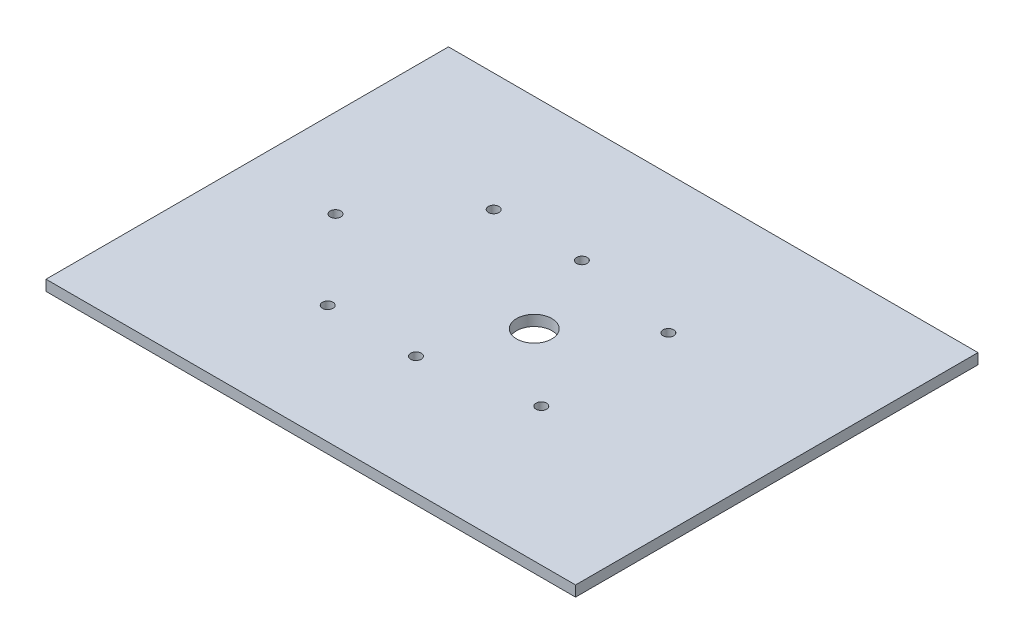
ISO-10303-21;
HEADER;
FILE_DESCRIPTION(('STEP AP214'),'2;1');
FILE_NAME('part.step','',(''),(''),'','','');
FILE_SCHEMA(('AUTOMOTIVE_DESIGN { 1 0 10303 214 1 1 1 1 }'));
ENDSEC;
DATA;
#1=APPLICATION_CONTEXT('core data for automotive mechanical design processes');
#2=APPLICATION_PROTOCOL_DEFINITION('international standard','automotive_design',2000,#1);
#3=PRODUCT_CONTEXT('',#1,'mechanical');
#4=PRODUCT('Part','Part','',(#3));
#5=PRODUCT_RELATED_PRODUCT_CATEGORY('part','',(#4));
#6=PRODUCT_DEFINITION_FORMATION('','',#4);
#7=PRODUCT_DEFINITION_CONTEXT('part definition',#1,'design');
#8=PRODUCT_DEFINITION('design','',#6,#7);
#9=PRODUCT_DEFINITION_SHAPE('','',#8);
#10=(LENGTH_UNIT() NAMED_UNIT(*) SI_UNIT(.MILLI.,.METRE.));
#11=(NAMED_UNIT(*) PLANE_ANGLE_UNIT() SI_UNIT($,.RADIAN.));
#12=(NAMED_UNIT(*) SI_UNIT($,.STERADIAN.) SOLID_ANGLE_UNIT());
#13=UNCERTAINTY_MEASURE_WITH_UNIT(LENGTH_MEASURE(1.E-05),#10,'distance_accuracy_value','');
#14=(GEOMETRIC_REPRESENTATION_CONTEXT(3) GLOBAL_UNCERTAINTY_ASSIGNED_CONTEXT((#13)) GLOBAL_UNIT_ASSIGNED_CONTEXT((#10,
#11,#12)) REPRESENTATION_CONTEXT('',''));
#15=CARTESIAN_POINT('',(0.,0.,0.));
#16=DIRECTION('',(0.,0.,1.));
#17=DIRECTION('',(1.,0.,0.));
#18=AXIS2_PLACEMENT_3D('',#15,#16,#17);
#19=CARTESIAN_POINT('',(0.,3.,114.));
#20=DIRECTION('',(1.,0.,0.));
#21=DIRECTION('',(0.,0.,-1.));
#22=AXIS2_PLACEMENT_3D('',#19,#20,#21);
#23=PLANE('',#22);
#24=DIRECTION('',(0.,0.,1.));
#25=VECTOR('',#24,1.);
#26=CARTESIAN_POINT('',(0.,0.,114.));
#27=LINE('',#26,#25);
#28=CARTESIAN_POINT('',(0.,0.,0.));
#29=VERTEX_POINT('',#28);
#30=CARTESIAN_POINT('',(0.,0.,114.));
#31=VERTEX_POINT('',#30);
#32=EDGE_CURVE('E106',#29,#31,#27,.T.);
#33=ORIENTED_EDGE('',*,*,#32,.T.);
#34=DIRECTION('',(0.,-1.,0.));
#35=VECTOR('',#34,1.);
#36=CARTESIAN_POINT('',(0.,3.,114.));
#37=LINE('',#36,#35);
#38=CARTESIAN_POINT('',(0.,3.,114.));
#39=VERTEX_POINT('',#38);
#40=EDGE_CURVE('E11',#39,#31,#37,.T.);
#41=ORIENTED_EDGE('',*,*,#40,.F.);
#42=DIRECTION('',(0.,0.,1.));
#43=VECTOR('',#42,1.);
#44=CARTESIAN_POINT('',(0.,3.,114.));
#45=LINE('',#44,#43);
#46=CARTESIAN_POINT('',(0.,3.,0.));
#47=VERTEX_POINT('',#46);
#48=EDGE_CURVE('E90',#47,#39,#45,.T.);
#49=ORIENTED_EDGE('',*,*,#48,.F.);
#50=DIRECTION('',(0.,-1.,0.));
#51=VECTOR('',#50,1.);
#52=CARTESIAN_POINT('',(0.,3.,0.));
#53=LINE('',#52,#51);
#54=EDGE_CURVE('E102',#47,#29,#53,.T.);
#55=ORIENTED_EDGE('',*,*,#54,.T.);
#56=EDGE_LOOP('',(#33,#41,#49,#55));
#57=FACE_BOUND('',#56,.T.);
#58=ADVANCED_FACE('F38',(#57),#23,.F.);
#59=CARTESIAN_POINT('',(150.,3.,114.));
#60=DIRECTION('',(0.,0.,-1.));
#61=DIRECTION('',(-1.,0.,0.));
#62=AXIS2_PLACEMENT_3D('',#59,#60,#61);
#63=PLANE('',#62);
#64=DIRECTION('',(1.,0.,0.));
#65=VECTOR('',#64,1.);
#66=CARTESIAN_POINT('',(150.,0.,114.));
#67=LINE('',#66,#65);
#68=CARTESIAN_POINT('',(150.,0.,114.));
#69=VERTEX_POINT('',#68);
#70=EDGE_CURVE('E95',#31,#69,#67,.T.);
#71=ORIENTED_EDGE('',*,*,#70,.T.);
#72=DIRECTION('',(0.,-1.,0.));
#73=VECTOR('',#72,1.);
#74=CARTESIAN_POINT('',(150.,3.,114.));
#75=LINE('',#74,#73);
#76=CARTESIAN_POINT('',(150.,3.,114.));
#77=VERTEX_POINT('',#76);
#78=EDGE_CURVE('E47',#77,#69,#75,.T.);
#79=ORIENTED_EDGE('',*,*,#78,.F.);
#80=DIRECTION('',(1.,0.,0.));
#81=VECTOR('',#80,1.);
#82=CARTESIAN_POINT('',(150.,3.,114.));
#83=LINE('',#82,#81);
#84=EDGE_CURVE('E85',#39,#77,#83,.T.);
#85=ORIENTED_EDGE('',*,*,#84,.F.);
#86=ORIENTED_EDGE('',*,*,#40,.T.);
#87=EDGE_LOOP('',(#71,#79,#85,#86));
#88=FACE_BOUND('',#87,.T.);
#89=ADVANCED_FACE('F94',(#88),#63,.F.);
#90=CARTESIAN_POINT('',(150.,3.,0.));
#91=DIRECTION('',(-1.,0.,0.));
#92=DIRECTION('',(0.,0.,1.));
#93=AXIS2_PLACEMENT_3D('',#90,#91,#92);
#94=PLANE('',#93);
#95=DIRECTION('',(0.,0.,-1.));
#96=VECTOR('',#95,1.);
#97=CARTESIAN_POINT('',(150.,0.,0.));
#98=LINE('',#97,#96);
#99=CARTESIAN_POINT('',(150.,0.,0.));
#100=VERTEX_POINT('',#99);
#101=EDGE_CURVE('E72',#69,#100,#98,.T.);
#102=ORIENTED_EDGE('',*,*,#101,.T.);
#103=DIRECTION('',(0.,-1.,0.));
#104=VECTOR('',#103,1.);
#105=CARTESIAN_POINT('',(150.,3.,0.));
#106=LINE('',#105,#104);
#107=CARTESIAN_POINT('',(150.,3.,0.));
#108=VERTEX_POINT('',#107);
#109=EDGE_CURVE('E97',#108,#100,#106,.T.);
#110=ORIENTED_EDGE('',*,*,#109,.F.);
#111=DIRECTION('',(0.,0.,-1.));
#112=VECTOR('',#111,1.);
#113=CARTESIAN_POINT('',(150.,3.,0.));
#114=LINE('',#113,#112);
#115=EDGE_CURVE('E88',#77,#108,#114,.T.);
#116=ORIENTED_EDGE('',*,*,#115,.F.);
#117=ORIENTED_EDGE('',*,*,#78,.T.);
#118=EDGE_LOOP('',(#102,#110,#116,#117));
#119=FACE_BOUND('',#118,.T.);
#120=ADVANCED_FACE('F98',(#119),#94,.F.);
#121=CARTESIAN_POINT('',(0.,3.,0.));
#122=DIRECTION('',(0.,0.,1.));
#123=DIRECTION('',(1.,0.,0.));
#124=AXIS2_PLACEMENT_3D('',#121,#122,#123);
#125=PLANE('',#124);
#126=DIRECTION('',(-1.,0.,0.));
#127=VECTOR('',#126,1.);
#128=CARTESIAN_POINT('',(0.,0.,0.));
#129=LINE('',#128,#127);
#130=EDGE_CURVE('E78',#100,#29,#129,.T.);
#131=ORIENTED_EDGE('',*,*,#130,.T.);
#132=ORIENTED_EDGE('',*,*,#54,.F.);
#133=DIRECTION('',(-1.,0.,0.));
#134=VECTOR('',#133,1.);
#135=CARTESIAN_POINT('',(0.,3.,0.));
#136=LINE('',#135,#134);
#137=EDGE_CURVE('E55',#108,#47,#136,.T.);
#138=ORIENTED_EDGE('',*,*,#137,.F.);
#139=ORIENTED_EDGE('',*,*,#109,.T.);
#140=EDGE_LOOP('',(#131,#132,#138,#139));
#141=FACE_BOUND('',#140,.T.);
#142=ADVANCED_FACE('F120',(#141),#125,.F.);
#143=CARTESIAN_POINT('',(0.,3.,0.));
#144=DIRECTION('',(0.,-1.,0.));
#145=DIRECTION('',(0.,0.,-1.));
#146=AXIS2_PLACEMENT_3D('',#143,#144,#145);
#147=PLANE('',#146);
#148=CARTESIAN_POINT('',(25.,3.,57.));
#149=DIRECTION('',(0.,1.,0.));
#150=DIRECTION('',(0.,0.,1.));
#151=AXIS2_PLACEMENT_3D('',#148,#149,#150);
#152=CIRCLE('',#151,1.5);
#153=CARTESIAN_POINT('',(25.,3.,58.5));
#154=VERTEX_POINT('',#153);
#155=EDGE_CURVE('E160',#154,#154,#152,.T.);
#156=ORIENTED_EDGE('',*,*,#155,.F.);
#157=EDGE_LOOP('',(#156));
#158=FACE_BOUND('',#157,.T.);
#159=CARTESIAN_POINT('',(81.3,3.,57.));
#160=DIRECTION('',(0.,1.,0.));
#161=DIRECTION('',(0.,0.,1.));
#162=AXIS2_PLACEMENT_3D('',#159,#160,#161);
#163=CIRCLE('',#162,5.00000000000001);
#164=CARTESIAN_POINT('',(81.3,3.,62.));
#165=VERTEX_POINT('',#164);
#166=EDGE_CURVE('E161',#165,#165,#163,.T.);
#167=ORIENTED_EDGE('',*,*,#166,.F.);
#168=EDGE_LOOP('',(#167));
#169=FACE_BOUND('',#168,.T.);
#170=CARTESIAN_POINT('',(46.3,3.,33.5));
#171=DIRECTION('',(0.,1.,0.));
#172=DIRECTION('',(0.,0.,1.));
#173=AXIS2_PLACEMENT_3D('',#170,#171,#172);
#174=CIRCLE('',#173,1.5);
#175=CARTESIAN_POINT('',(46.3,3.,35.));
#176=VERTEX_POINT('',#175);
#177=EDGE_CURVE('E169',#176,#176,#174,.T.);
#178=ORIENTED_EDGE('',*,*,#177,.F.);
#179=EDGE_LOOP('',(#178));
#180=FACE_BOUND('',#179,.T.);
#181=CARTESIAN_POINT('',(71.3,3.,33.5));
#182=DIRECTION('',(0.,1.,0.));
#183=DIRECTION('',(0.,0.,1.));
#184=AXIS2_PLACEMENT_3D('',#181,#182,#183);
#185=CIRCLE('',#184,1.5);
#186=CARTESIAN_POINT('',(71.3,3.,35.));
#187=VERTEX_POINT('',#186);
#188=EDGE_CURVE('E177',#187,#187,#185,.T.);
#189=ORIENTED_EDGE('',*,*,#188,.F.);
#190=EDGE_LOOP('',(#189));
#191=FACE_BOUND('',#190,.T.);
#192=CARTESIAN_POINT('',(46.3,3.,80.5));
#193=DIRECTION('',(0.,1.,0.));
#194=DIRECTION('',(0.,0.,1.));
#195=AXIS2_PLACEMENT_3D('',#192,#193,#194);
#196=CIRCLE('',#195,1.5);
#197=CARTESIAN_POINT('',(46.3,3.,82.));
#198=VERTEX_POINT('',#197);
#199=EDGE_CURVE('E127',#198,#198,#196,.T.);
#200=ORIENTED_EDGE('',*,*,#199,.F.);
#201=EDGE_LOOP('',(#200));
#202=FACE_BOUND('',#201,.T.);
#203=CARTESIAN_POINT('',(71.3,3.,80.5));
#204=DIRECTION('',(0.,1.,0.));
#205=DIRECTION('',(0.,0.,1.));
#206=AXIS2_PLACEMENT_3D('',#203,#204,#205);
#207=CIRCLE('',#206,1.5);
#208=CARTESIAN_POINT('',(71.3,3.,82.));
#209=VERTEX_POINT('',#208);
#210=EDGE_CURVE('E136',#209,#209,#207,.T.);
#211=ORIENTED_EDGE('',*,*,#210,.F.);
#212=EDGE_LOOP('',(#211));
#213=FACE_BOUND('',#212,.T.);
#214=CARTESIAN_POINT('',(101.3,3.,39.));
#215=DIRECTION('',(0.,1.,0.));
#216=DIRECTION('',(0.,0.,1.));
#217=AXIS2_PLACEMENT_3D('',#214,#215,#216);
#218=CIRCLE('',#217,1.5);
#219=CARTESIAN_POINT('',(101.3,3.,40.5));
#220=VERTEX_POINT('',#219);
#221=EDGE_CURVE('E144',#220,#220,#218,.T.);
#222=ORIENTED_EDGE('',*,*,#221,.F.);
#223=EDGE_LOOP('',(#222));
#224=FACE_BOUND('',#223,.T.);
#225=CARTESIAN_POINT('',(101.3,3.,75.));
#226=DIRECTION('',(0.,1.,0.));
#227=DIRECTION('',(0.,0.,1.));
#228=AXIS2_PLACEMENT_3D('',#225,#226,#227);
#229=CIRCLE('',#228,1.5);
#230=CARTESIAN_POINT('',(101.3,3.,76.5));
#231=VERTEX_POINT('',#230);
#232=EDGE_CURVE('E152',#231,#231,#229,.T.);
#233=ORIENTED_EDGE('',*,*,#232,.F.);
#234=EDGE_LOOP('',(#233));
#235=FACE_BOUND('',#234,.T.);
#236=ORIENTED_EDGE('',*,*,#48,.T.);
#237=ORIENTED_EDGE('',*,*,#84,.T.);
#238=ORIENTED_EDGE('',*,*,#115,.T.);
#239=ORIENTED_EDGE('',*,*,#137,.T.);
#240=EDGE_LOOP('',(#236,#237,#238,#239));
#241=FACE_BOUND('',#240,.T.);
#242=ADVANCED_FACE('F86',(#158,#169,#180,#191,#202,#213,#224,#235,#241),#147,.F.);
#243=CARTESIAN_POINT('',(0.,0.,0.));
#244=DIRECTION('',(0.,-1.,0.));
#245=DIRECTION('',(0.,0.,-1.));
#246=AXIS2_PLACEMENT_3D('',#243,#244,#245);
#247=PLANE('',#246);
#248=CARTESIAN_POINT('',(25.,0.,57.));
#249=DIRECTION('',(0.,1.,0.));
#250=DIRECTION('',(0.,0.,1.));
#251=AXIS2_PLACEMENT_3D('',#248,#249,#250);
#252=CIRCLE('',#251,1.5);
#253=CARTESIAN_POINT('',(25.,0.,58.5));
#254=VERTEX_POINT('',#253);
#255=EDGE_CURVE('E110',#254,#254,#252,.T.);
#256=ORIENTED_EDGE('',*,*,#255,.T.);
#257=EDGE_LOOP('',(#256));
#258=FACE_BOUND('',#257,.T.);
#259=CARTESIAN_POINT('',(81.3,0.,57.));
#260=DIRECTION('',(0.,1.,0.));
#261=DIRECTION('',(0.,0.,1.));
#262=AXIS2_PLACEMENT_3D('',#259,#260,#261);
#263=CIRCLE('',#262,5.00000000000001);
#264=CARTESIAN_POINT('',(81.3,0.,62.));
#265=VERTEX_POINT('',#264);
#266=EDGE_CURVE('E165',#265,#265,#263,.T.);
#267=ORIENTED_EDGE('',*,*,#266,.T.);
#268=EDGE_LOOP('',(#267));
#269=FACE_BOUND('',#268,.T.);
#270=CARTESIAN_POINT('',(46.3,0.,33.5));
#271=DIRECTION('',(0.,1.,0.));
#272=DIRECTION('',(0.,0.,1.));
#273=AXIS2_PLACEMENT_3D('',#270,#271,#272);
#274=CIRCLE('',#273,1.5);
#275=CARTESIAN_POINT('',(46.3,0.,35.));
#276=VERTEX_POINT('',#275);
#277=EDGE_CURVE('E173',#276,#276,#274,.T.);
#278=ORIENTED_EDGE('',*,*,#277,.T.);
#279=EDGE_LOOP('',(#278));
#280=FACE_BOUND('',#279,.T.);
#281=CARTESIAN_POINT('',(71.3,0.,33.5));
#282=DIRECTION('',(0.,1.,0.));
#283=DIRECTION('',(0.,0.,1.));
#284=AXIS2_PLACEMENT_3D('',#281,#282,#283);
#285=CIRCLE('',#284,1.5);
#286=CARTESIAN_POINT('',(71.3,0.,35.));
#287=VERTEX_POINT('',#286);
#288=EDGE_CURVE('E132',#287,#287,#285,.T.);
#289=ORIENTED_EDGE('',*,*,#288,.T.);
#290=EDGE_LOOP('',(#289));
#291=FACE_BOUND('',#290,.T.);
#292=CARTESIAN_POINT('',(46.3,0.,80.5));
#293=DIRECTION('',(0.,1.,0.));
#294=DIRECTION('',(0.,0.,1.));
#295=AXIS2_PLACEMENT_3D('',#292,#293,#294);
#296=CIRCLE('',#295,1.5);
#297=CARTESIAN_POINT('',(46.3,0.,82.));
#298=VERTEX_POINT('',#297);
#299=EDGE_CURVE('E131',#298,#298,#296,.T.);
#300=ORIENTED_EDGE('',*,*,#299,.T.);
#301=EDGE_LOOP('',(#300));
#302=FACE_BOUND('',#301,.T.);
#303=CARTESIAN_POINT('',(71.3,0.,80.5));
#304=DIRECTION('',(0.,1.,0.));
#305=DIRECTION('',(0.,0.,1.));
#306=AXIS2_PLACEMENT_3D('',#303,#304,#305);
#307=CIRCLE('',#306,1.5);
#308=CARTESIAN_POINT('',(71.3,0.,82.));
#309=VERTEX_POINT('',#308);
#310=EDGE_CURVE('E140',#309,#309,#307,.T.);
#311=ORIENTED_EDGE('',*,*,#310,.T.);
#312=EDGE_LOOP('',(#311));
#313=FACE_BOUND('',#312,.T.);
#314=CARTESIAN_POINT('',(101.3,0.,39.));
#315=DIRECTION('',(0.,1.,0.));
#316=DIRECTION('',(0.,0.,1.));
#317=AXIS2_PLACEMENT_3D('',#314,#315,#316);
#318=CIRCLE('',#317,1.5);
#319=CARTESIAN_POINT('',(101.3,0.,40.5));
#320=VERTEX_POINT('',#319);
#321=EDGE_CURVE('E148',#320,#320,#318,.T.);
#322=ORIENTED_EDGE('',*,*,#321,.T.);
#323=EDGE_LOOP('',(#322));
#324=FACE_BOUND('',#323,.T.);
#325=CARTESIAN_POINT('',(101.3,0.,75.));
#326=DIRECTION('',(0.,1.,0.));
#327=DIRECTION('',(0.,0.,1.));
#328=AXIS2_PLACEMENT_3D('',#325,#326,#327);
#329=CIRCLE('',#328,1.5);
#330=CARTESIAN_POINT('',(101.3,0.,76.5));
#331=VERTEX_POINT('',#330);
#332=EDGE_CURVE('E156',#331,#331,#329,.T.);
#333=ORIENTED_EDGE('',*,*,#332,.T.);
#334=EDGE_LOOP('',(#333));
#335=FACE_BOUND('',#334,.T.);
#336=ORIENTED_EDGE('',*,*,#32,.F.);
#337=ORIENTED_EDGE('',*,*,#130,.F.);
#338=ORIENTED_EDGE('',*,*,#101,.F.);
#339=ORIENTED_EDGE('',*,*,#70,.F.);
#340=EDGE_LOOP('',(#336,#337,#338,#339));
#341=FACE_BOUND('',#340,.T.);
#342=ADVANCED_FACE('F123',(#258,#269,#280,#291,#302,#313,#324,#335,#341),#247,.T.);
#343=CARTESIAN_POINT('',(101.3,0.,75.));
#344=DIRECTION('',(0.,1.,0.));
#345=DIRECTION('',(0.,0.,1.));
#346=AXIS2_PLACEMENT_3D('',#343,#344,#345);
#347=CYLINDRICAL_SURFACE('',#346,1.5);
#348=ORIENTED_EDGE('',*,*,#332,.F.);
#349=EDGE_LOOP('',(#348));
#350=FACE_BOUND('',#349,.T.);
#351=ORIENTED_EDGE('',*,*,#232,.T.);
#352=EDGE_LOOP('',(#351));
#353=FACE_BOUND('',#352,.T.);
#354=ADVANCED_FACE('F217',(#350,#353),#347,.F.);
#355=CARTESIAN_POINT('',(101.3,0.,39.));
#356=DIRECTION('',(0.,1.,0.));
#357=DIRECTION('',(0.,0.,1.));
#358=AXIS2_PLACEMENT_3D('',#355,#356,#357);
#359=CYLINDRICAL_SURFACE('',#358,1.5);
#360=ORIENTED_EDGE('',*,*,#321,.F.);
#361=EDGE_LOOP('',(#360));
#362=FACE_BOUND('',#361,.T.);
#363=ORIENTED_EDGE('',*,*,#221,.T.);
#364=EDGE_LOOP('',(#363));
#365=FACE_BOUND('',#364,.T.);
#366=ADVANCED_FACE('F219',(#362,#365),#359,.F.);
#367=CARTESIAN_POINT('',(71.3,0.,80.5));
#368=DIRECTION('',(0.,1.,0.));
#369=DIRECTION('',(0.,0.,1.));
#370=AXIS2_PLACEMENT_3D('',#367,#368,#369);
#371=CYLINDRICAL_SURFACE('',#370,1.5);
#372=ORIENTED_EDGE('',*,*,#310,.F.);
#373=EDGE_LOOP('',(#372));
#374=FACE_BOUND('',#373,.T.);
#375=ORIENTED_EDGE('',*,*,#210,.T.);
#376=EDGE_LOOP('',(#375));
#377=FACE_BOUND('',#376,.T.);
#378=ADVANCED_FACE('F226',(#374,#377),#371,.F.);
#379=CARTESIAN_POINT('',(46.3,0.,80.5));
#380=DIRECTION('',(0.,1.,0.));
#381=DIRECTION('',(0.,0.,1.));
#382=AXIS2_PLACEMENT_3D('',#379,#380,#381);
#383=CYLINDRICAL_SURFACE('',#382,1.5);
#384=ORIENTED_EDGE('',*,*,#299,.F.);
#385=EDGE_LOOP('',(#384));
#386=FACE_BOUND('',#385,.T.);
#387=ORIENTED_EDGE('',*,*,#199,.T.);
#388=EDGE_LOOP('',(#387));
#389=FACE_BOUND('',#388,.T.);
#390=ADVANCED_FACE('F244',(#386,#389),#383,.F.);
#391=CARTESIAN_POINT('',(71.3,0.,33.5));
#392=DIRECTION('',(0.,1.,0.));
#393=DIRECTION('',(0.,0.,1.));
#394=AXIS2_PLACEMENT_3D('',#391,#392,#393);
#395=CYLINDRICAL_SURFACE('',#394,1.5);
#396=ORIENTED_EDGE('',*,*,#288,.F.);
#397=EDGE_LOOP('',(#396));
#398=FACE_BOUND('',#397,.T.);
#399=ORIENTED_EDGE('',*,*,#188,.T.);
#400=EDGE_LOOP('',(#399));
#401=FACE_BOUND('',#400,.T.);
#402=ADVANCED_FACE('F247',(#398,#401),#395,.F.);
#403=CARTESIAN_POINT('',(46.3,0.,33.5));
#404=DIRECTION('',(0.,1.,0.));
#405=DIRECTION('',(0.,0.,1.));
#406=AXIS2_PLACEMENT_3D('',#403,#404,#405);
#407=CYLINDRICAL_SURFACE('',#406,1.5);
#408=ORIENTED_EDGE('',*,*,#277,.F.);
#409=EDGE_LOOP('',(#408));
#410=FACE_BOUND('',#409,.T.);
#411=ORIENTED_EDGE('',*,*,#177,.T.);
#412=EDGE_LOOP('',(#411));
#413=FACE_BOUND('',#412,.T.);
#414=ADVANCED_FACE('F272',(#410,#413),#407,.F.);
#415=CARTESIAN_POINT('',(81.3,0.,57.));
#416=DIRECTION('',(0.,1.,0.));
#417=DIRECTION('',(0.,0.,1.));
#418=AXIS2_PLACEMENT_3D('',#415,#416,#417);
#419=CYLINDRICAL_SURFACE('',#418,5.00000000000001);
#420=ORIENTED_EDGE('',*,*,#266,.F.);
#421=EDGE_LOOP('',(#420));
#422=FACE_BOUND('',#421,.T.);
#423=ORIENTED_EDGE('',*,*,#166,.T.);
#424=EDGE_LOOP('',(#423));
#425=FACE_BOUND('',#424,.T.);
#426=ADVANCED_FACE('F196',(#422,#425),#419,.F.);
#427=CARTESIAN_POINT('',(25.,0.,57.));
#428=DIRECTION('',(0.,1.,0.));
#429=DIRECTION('',(0.,0.,1.));
#430=AXIS2_PLACEMENT_3D('',#427,#428,#429);
#431=CYLINDRICAL_SURFACE('',#430,1.5);
#432=ORIENTED_EDGE('',*,*,#255,.F.);
#433=EDGE_LOOP('',(#432));
#434=FACE_BOUND('',#433,.T.);
#435=ORIENTED_EDGE('',*,*,#155,.T.);
#436=EDGE_LOOP('',(#435));
#437=FACE_BOUND('',#436,.T.);
#438=ADVANCED_FACE('F193',(#434,#437),#431,.F.);
#439=CLOSED_SHELL('',(#58,#89,#120,#142,#242,#342,#354,#366,#378,#390,#402,#414,#426,#438));
#440=MANIFOLD_SOLID_BREP('B2',#439);
#441=ADVANCED_BREP_SHAPE_REPRESENTATION('',(#18,#440),#14);
#442=SHAPE_DEFINITION_REPRESENTATION(#9,#441);
ENDSEC;
END-ISO-10303-21;
